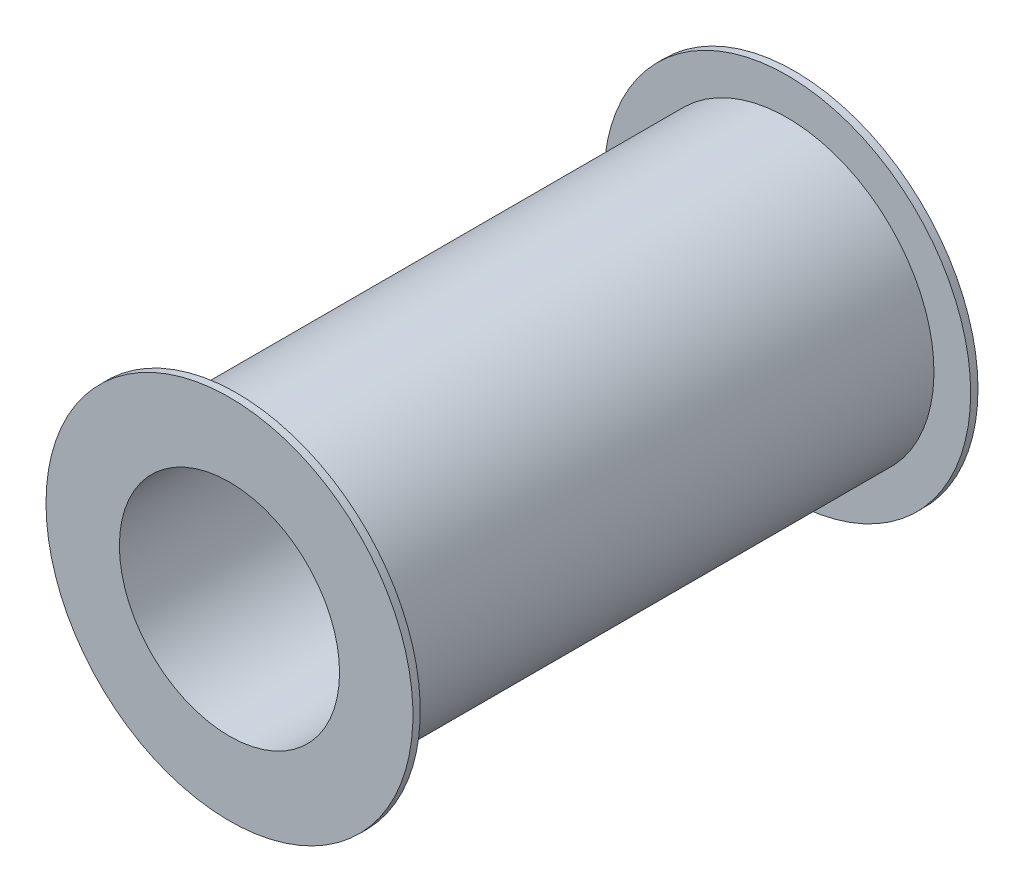
ISO-10303-21;
HEADER;
FILE_DESCRIPTION(('STEP AP214'),'2;1');
FILE_NAME('part.step','',(''),(''),'','','');
FILE_SCHEMA(('AUTOMOTIVE_DESIGN { 1 0 10303 214 1 1 1 1 }'));
ENDSEC;
DATA;
#1=APPLICATION_CONTEXT('core data for automotive mechanical design processes');
#2=APPLICATION_PROTOCOL_DEFINITION('international standard','automotive_design',2000,#1);
#3=PRODUCT_CONTEXT('',#1,'mechanical');
#4=PRODUCT('Part','Part','',(#3));
#5=PRODUCT_RELATED_PRODUCT_CATEGORY('part','',(#4));
#6=PRODUCT_DEFINITION_FORMATION('','',#4);
#7=PRODUCT_DEFINITION_CONTEXT('part definition',#1,'design');
#8=PRODUCT_DEFINITION('design','',#6,#7);
#9=PRODUCT_DEFINITION_SHAPE('','',#8);
#10=(LENGTH_UNIT() NAMED_UNIT(*) SI_UNIT(.MILLI.,.METRE.));
#11=(NAMED_UNIT(*) PLANE_ANGLE_UNIT() SI_UNIT($,.RADIAN.));
#12=(NAMED_UNIT(*) SI_UNIT($,.STERADIAN.) SOLID_ANGLE_UNIT());
#13=UNCERTAINTY_MEASURE_WITH_UNIT(LENGTH_MEASURE(1.E-05),#10,'distance_accuracy_value','');
#14=(GEOMETRIC_REPRESENTATION_CONTEXT(3) GLOBAL_UNCERTAINTY_ASSIGNED_CONTEXT((#13)) GLOBAL_UNIT_ASSIGNED_CONTEXT((#10,
#11,#12)) REPRESENTATION_CONTEXT('',''));
#15=CARTESIAN_POINT('',(0.,0.,0.));
#16=DIRECTION('',(0.,0.,1.));
#17=DIRECTION('',(1.,0.,0.));
#18=AXIS2_PLACEMENT_3D('',#15,#16,#17);
#19=CARTESIAN_POINT('',(10.125,-4.2,-5.48));
#20=DIRECTION('',(0.,0.,-1.));
#21=DIRECTION('',(-1.,0.,0.));
#22=AXIS2_PLACEMENT_3D('',#19,#20,#21);
#23=CYLINDRICAL_SURFACE('',#22,0.5);
#24=CARTESIAN_POINT('',(10.125,-4.2,-5.5));
#25=DIRECTION('',(0.,0.,-1.));
#26=DIRECTION('',(-1.,0.,0.));
#27=AXIS2_PLACEMENT_3D('',#24,#25,#26);
#28=CIRCLE('',#27,0.5);
#29=CARTESIAN_POINT('',(9.625,-4.2,-5.5));
#30=VERTEX_POINT('',#29);
#31=EDGE_CURVE('E41',#30,#30,#28,.T.);
#32=ORIENTED_EDGE('',*,*,#31,.F.);
#33=EDGE_LOOP('',(#32));
#34=FACE_BOUND('',#33,.T.);
#35=CARTESIAN_POINT('',(10.125,-4.2,-5.48));
#36=DIRECTION('',(0.,0.,-1.));
#37=DIRECTION('',(-1.,0.,0.));
#38=AXIS2_PLACEMENT_3D('',#35,#36,#37);
#39=CIRCLE('',#38,0.5);
#40=CARTESIAN_POINT('',(9.625,-4.2,-5.48));
#41=VERTEX_POINT('',#40);
#42=EDGE_CURVE('E19',#41,#41,#39,.F.);
#43=ORIENTED_EDGE('',*,*,#42,.F.);
#44=EDGE_LOOP('',(#43));
#45=FACE_BOUND('',#44,.T.);
#46=ADVANCED_FACE('F15',(#34,#45),#23,.T.);
#47=CARTESIAN_POINT('',(9.624,-4.701,-5.48));
#48=DIRECTION('',(0.,0.,1.));
#49=DIRECTION('',(1.,0.,0.));
#50=AXIS2_PLACEMENT_3D('',#47,#48,#49);
#51=PLANE('',#50);
#52=CARTESIAN_POINT('',(10.125,-4.2,-5.48));
#53=DIRECTION('',(0.,0.,-1.));
#54=DIRECTION('',(-1.,0.,0.));
#55=AXIS2_PLACEMENT_3D('',#52,#53,#54);
#56=CIRCLE('',#55,0.299999999999996);
#57=CARTESIAN_POINT('',(9.82500000000001,-4.2,-5.48));
#58=VERTEX_POINT('',#57);
#59=EDGE_CURVE('E39',#58,#58,#56,.F.);
#60=ORIENTED_EDGE('',*,*,#59,.F.);
#61=EDGE_LOOP('',(#60));
#62=FACE_BOUND('',#61,.T.);
#63=ORIENTED_EDGE('',*,*,#42,.T.);
#64=EDGE_LOOP('',(#63));
#65=FACE_BOUND('',#64,.T.);
#66=ADVANCED_FACE('F48',(#62,#65),#51,.T.);
#67=CARTESIAN_POINT('',(10.626,-4.701,-5.5));
#68=DIRECTION('',(0.,0.,-1.));
#69=DIRECTION('',(-1.,0.,0.));
#70=AXIS2_PLACEMENT_3D('',#67,#68,#69);
#71=PLANE('',#70);
#72=CARTESIAN_POINT('',(10.1249999999999,-4.20000000000007,-5.5));
#73=DIRECTION('',(0.,0.,1.));
#74=DIRECTION('',(0.,-1.,0.));
#75=AXIS2_PLACEMENT_3D('',#72,#73,#74);
#76=CIRCLE('',#75,0.399999999999944);
#77=CARTESIAN_POINT('',(10.1249999999999,-4.60000000000001,-5.5));
#78=VERTEX_POINT('',#77);
#79=EDGE_CURVE('E36',#78,#78,#76,.F.);
#80=ORIENTED_EDGE('',*,*,#79,.F.);
#81=EDGE_LOOP('',(#80));
#82=FACE_BOUND('',#81,.T.);
#83=ORIENTED_EDGE('',*,*,#31,.T.);
#84=EDGE_LOOP('',(#83));
#85=FACE_BOUND('',#84,.T.);
#86=ADVANCED_FACE('F57',(#82,#85),#71,.T.);
#87=CARTESIAN_POINT('',(10.125,-4.2,-5.48));
#88=DIRECTION('',(0.,0.,-1.));
#89=DIRECTION('',(-1.,0.,0.));
#90=AXIS2_PLACEMENT_3D('',#87,#88,#89);
#91=CYLINDRICAL_SURFACE('',#90,0.299999999999996);
#92=CARTESIAN_POINT('',(10.125,-4.2,-7.02));
#93=DIRECTION('',(0.,0.,-1.));
#94=DIRECTION('',(-1.,0.,0.));
#95=AXIS2_PLACEMENT_3D('',#92,#93,#94);
#96=CIRCLE('',#95,0.299999999999996);
#97=CARTESIAN_POINT('',(9.82500000000001,-4.2,-7.02));
#98=VERTEX_POINT('',#97);
#99=EDGE_CURVE('E33',#98,#98,#96,.F.);
#100=ORIENTED_EDGE('',*,*,#99,.F.);
#101=EDGE_LOOP('',(#100));
#102=FACE_BOUND('',#101,.T.);
#103=ORIENTED_EDGE('',*,*,#59,.T.);
#104=EDGE_LOOP('',(#103));
#105=FACE_BOUND('',#104,.T.);
#106=ADVANCED_FACE('F77',(#102,#105),#91,.F.);
#107=CARTESIAN_POINT('',(10.1249999999999,-4.20000000000007,-7.));
#108=DIRECTION('',(0.,0.,1.));
#109=DIRECTION('',(0.,-1.,0.));
#110=AXIS2_PLACEMENT_3D('',#107,#108,#109);
#111=CYLINDRICAL_SURFACE('',#110,0.399999999999944);
#112=ORIENTED_EDGE('',*,*,#79,.T.);
#113=EDGE_LOOP('',(#112));
#114=FACE_BOUND('',#113,.T.);
#115=CARTESIAN_POINT('',(10.1249999999999,-4.20000000000007,-7.));
#116=DIRECTION('',(0.,0.,1.));
#117=DIRECTION('',(0.,-1.,0.));
#118=AXIS2_PLACEMENT_3D('',#115,#116,#117);
#119=CIRCLE('',#118,0.399999999999944);
#120=CARTESIAN_POINT('',(10.1249999999999,-4.60000000000002,-7.));
#121=VERTEX_POINT('',#120);
#122=EDGE_CURVE('E28',#121,#121,#119,.F.);
#123=ORIENTED_EDGE('',*,*,#122,.F.);
#124=EDGE_LOOP('',(#123));
#125=FACE_BOUND('',#124,.T.);
#126=ADVANCED_FACE('F71',(#114,#125),#111,.T.);
#127=CARTESIAN_POINT('',(9.624,-3.699,-7.02));
#128=DIRECTION('',(0.,0.,-1.));
#129=DIRECTION('',(1.,0.,0.));
#130=AXIS2_PLACEMENT_3D('',#127,#128,#129);
#131=PLANE('',#130);
#132=ORIENTED_EDGE('',*,*,#99,.T.);
#133=EDGE_LOOP('',(#132));
#134=FACE_BOUND('',#133,.T.);
#135=CARTESIAN_POINT('',(10.125,-4.2,-7.02));
#136=DIRECTION('',(0.,0.,1.));
#137=DIRECTION('',(1.,0.,0.));
#138=AXIS2_PLACEMENT_3D('',#135,#136,#137);
#139=CIRCLE('',#138,0.5);
#140=CARTESIAN_POINT('',(10.625,-4.2,-7.02));
#141=VERTEX_POINT('',#140);
#142=EDGE_CURVE('E23',#141,#141,#139,.T.);
#143=ORIENTED_EDGE('',*,*,#142,.F.);
#144=EDGE_LOOP('',(#143));
#145=FACE_BOUND('',#144,.T.);
#146=ADVANCED_FACE('F65',(#134,#145),#131,.T.);
#147=CARTESIAN_POINT('',(10.626,-3.699,-7.));
#148=DIRECTION('',(0.,0.,1.));
#149=DIRECTION('',(-1.,0.,0.));
#150=AXIS2_PLACEMENT_3D('',#147,#148,#149);
#151=PLANE('',#150);
#152=ORIENTED_EDGE('',*,*,#122,.T.);
#153=EDGE_LOOP('',(#152));
#154=FACE_BOUND('',#153,.T.);
#155=CARTESIAN_POINT('',(10.125,-4.2,-7.));
#156=DIRECTION('',(0.,0.,1.));
#157=DIRECTION('',(1.,0.,0.));
#158=AXIS2_PLACEMENT_3D('',#155,#156,#157);
#159=CIRCLE('',#158,0.5);
#160=CARTESIAN_POINT('',(10.625,-4.2,-7.));
#161=VERTEX_POINT('',#160);
#162=EDGE_CURVE('E10',#161,#161,#159,.F.);
#163=ORIENTED_EDGE('',*,*,#162,.F.);
#164=EDGE_LOOP('',(#163));
#165=FACE_BOUND('',#164,.T.);
#166=ADVANCED_FACE('F61',(#154,#165),#151,.T.);
#167=CARTESIAN_POINT('',(10.125,-4.2,-7.02));
#168=DIRECTION('',(0.,0.,1.));
#169=DIRECTION('',(1.,0.,0.));
#170=AXIS2_PLACEMENT_3D('',#167,#168,#169);
#171=CYLINDRICAL_SURFACE('',#170,0.5);
#172=ORIENTED_EDGE('',*,*,#162,.T.);
#173=EDGE_LOOP('',(#172));
#174=FACE_BOUND('',#173,.T.);
#175=ORIENTED_EDGE('',*,*,#142,.T.);
#176=EDGE_LOOP('',(#175));
#177=FACE_BOUND('',#176,.T.);
#178=ADVANCED_FACE('F17',(#174,#177),#171,.T.);
#179=CLOSED_SHELL('',(#46,#66,#86,#106,#126,#146,#166,#178));
#180=MANIFOLD_SOLID_BREP('B1',#179);
#181=ADVANCED_BREP_SHAPE_REPRESENTATION('',(#18,#180),#14);
#182=SHAPE_DEFINITION_REPRESENTATION(#9,#181);
ENDSEC;
END-ISO-10303-21;
